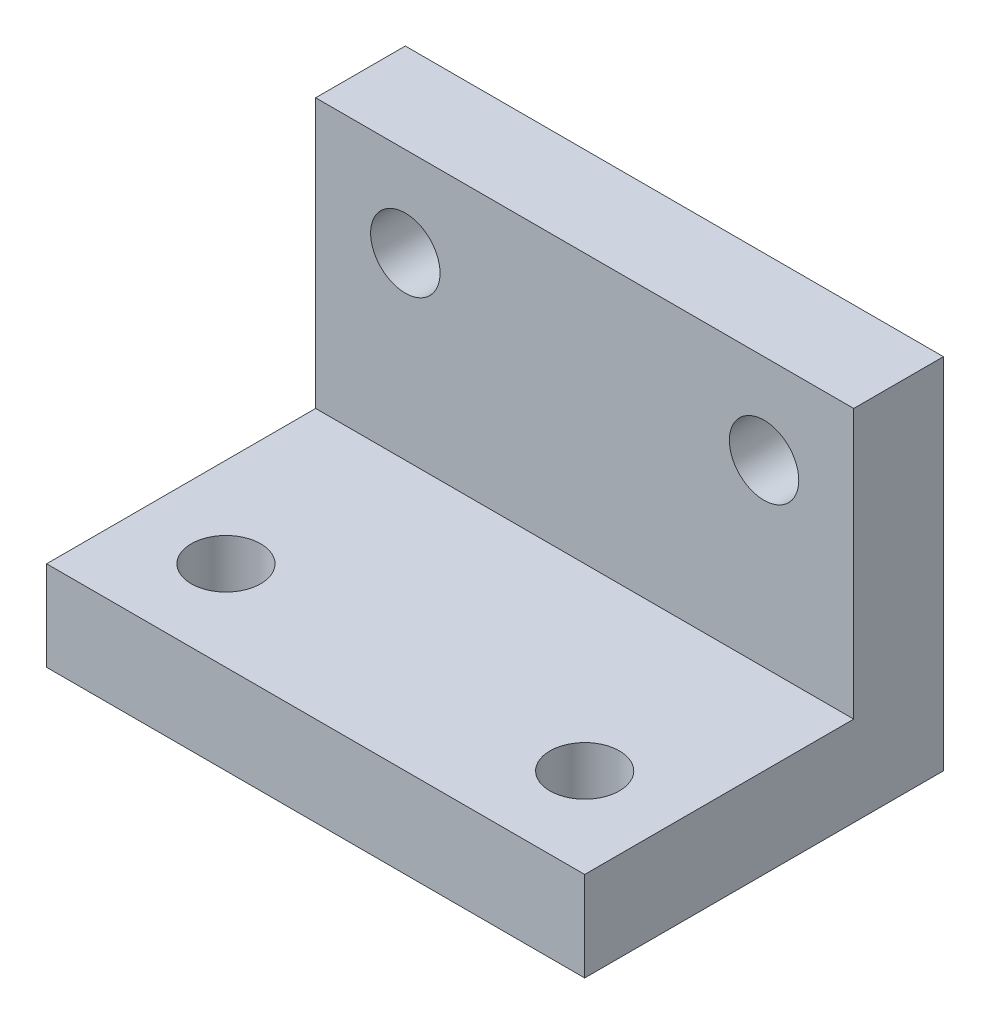
ISO-10303-21;
HEADER;
FILE_DESCRIPTION(('STEP AP214'),'2;1');
FILE_NAME('part.step','',(''),(''),'','','');
FILE_SCHEMA(('AUTOMOTIVE_DESIGN { 1 0 10303 214 1 1 1 1 }'));
ENDSEC;
DATA;
#1=APPLICATION_CONTEXT('core data for automotive mechanical design processes');
#2=APPLICATION_PROTOCOL_DEFINITION('international standard','automotive_design',2000,#1);
#3=PRODUCT_CONTEXT('',#1,'mechanical');
#4=PRODUCT('Part','Part','',(#3));
#5=PRODUCT_RELATED_PRODUCT_CATEGORY('part','',(#4));
#6=PRODUCT_DEFINITION_FORMATION('','',#4);
#7=PRODUCT_DEFINITION_CONTEXT('part definition',#1,'design');
#8=PRODUCT_DEFINITION('design','',#6,#7);
#9=PRODUCT_DEFINITION_SHAPE('','',#8);
#10=(LENGTH_UNIT() NAMED_UNIT(*) SI_UNIT(.MILLI.,.METRE.));
#11=(NAMED_UNIT(*) PLANE_ANGLE_UNIT() SI_UNIT($,.RADIAN.));
#12=(NAMED_UNIT(*) SI_UNIT($,.STERADIAN.) SOLID_ANGLE_UNIT());
#13=UNCERTAINTY_MEASURE_WITH_UNIT(LENGTH_MEASURE(1.E-05),#10,'distance_accuracy_value','');
#14=(GEOMETRIC_REPRESENTATION_CONTEXT(3) GLOBAL_UNCERTAINTY_ASSIGNED_CONTEXT((#13)) GLOBAL_UNIT_ASSIGNED_CONTEXT((#10,
#11,#12)) REPRESENTATION_CONTEXT('',''));
#15=CARTESIAN_POINT('',(0.,0.,0.));
#16=DIRECTION('',(0.,0.,1.));
#17=DIRECTION('',(1.,0.,0.));
#18=AXIS2_PLACEMENT_3D('',#15,#16,#17);
#19=CARTESIAN_POINT('',(-19.051,12.7,-6.34999999999999));
#20=DIRECTION('',(0.,0.,-1.));
#21=DIRECTION('',(-1.,0.,0.));
#22=AXIS2_PLACEMENT_3D('',#19,#20,#21);
#23=PLANE('',#22);
#24=CARTESIAN_POINT('',(-12.7,6.35,-6.35));
#25=DIRECTION('',(0.,0.,1.));
#26=DIRECTION('',(1.,0.,0.));
#27=AXIS2_PLACEMENT_3D('',#24,#25,#26);
#28=CIRCLE('',#27,2.45745);
#29=CARTESIAN_POINT('',(-10.24255,6.35,-6.35));
#30=VERTEX_POINT('',#29);
#31=EDGE_CURVE('E155',#30,#30,#28,.T.);
#32=ORIENTED_EDGE('',*,*,#31,.F.);
#33=EDGE_LOOP('',(#32));
#34=FACE_BOUND('',#33,.T.);
#35=DIRECTION('',(0.,-1.,0.));
#36=VECTOR('',#35,1.);
#37=CARTESIAN_POINT('',(-19.05,12.7,-6.34999999999999));
#38=LINE('',#37,#36);
#39=CARTESIAN_POINT('',(-19.05,12.7,-6.34999999999999));
#40=VERTEX_POINT('',#39);
#41=CARTESIAN_POINT('',(-19.05,-6.35,-6.34999999999999));
#42=VERTEX_POINT('',#41);
#43=EDGE_CURVE('E134',#40,#42,#38,.T.);
#44=ORIENTED_EDGE('',*,*,#43,.T.);
#45=DIRECTION('',(1.,0.,0.));
#46=VECTOR('',#45,1.);
#47=CARTESIAN_POINT('',(-19.051,-6.35,-6.34999999999999));
#48=LINE('',#47,#46);
#49=CARTESIAN_POINT('',(19.05,-6.35,-6.35));
#50=VERTEX_POINT('',#49);
#51=EDGE_CURVE('E135',#42,#50,#48,.T.);
#52=ORIENTED_EDGE('',*,*,#51,.T.);
#53=DIRECTION('',(0.,1.,0.));
#54=VECTOR('',#53,1.);
#55=CARTESIAN_POINT('',(19.05,12.7,-6.35));
#56=LINE('',#55,#54);
#57=CARTESIAN_POINT('',(19.05,12.7,-6.35));
#58=VERTEX_POINT('',#57);
#59=EDGE_CURVE('E49',#50,#58,#56,.T.);
#60=ORIENTED_EDGE('',*,*,#59,.T.);
#61=DIRECTION('',(1.,0.,0.));
#62=VECTOR('',#61,1.);
#63=CARTESIAN_POINT('',(-19.051,12.7,-6.34999999999999));
#64=LINE('',#63,#62);
#65=EDGE_CURVE('E104',#40,#58,#64,.T.);
#66=ORIENTED_EDGE('',*,*,#65,.F.);
#67=EDGE_LOOP('',(#44,#52,#60,#66));
#68=FACE_BOUND('',#67,.T.);
#69=CARTESIAN_POINT('',(12.7,6.35,-6.35));
#70=DIRECTION('',(0.,0.,1.));
#71=DIRECTION('',(1.,0.,0.));
#72=AXIS2_PLACEMENT_3D('',#69,#70,#71);
#73=CIRCLE('',#72,2.45745);
#74=CARTESIAN_POINT('',(15.15745,6.35,-6.35));
#75=VERTEX_POINT('',#74);
#76=EDGE_CURVE('E149',#75,#75,#73,.T.);
#77=ORIENTED_EDGE('',*,*,#76,.F.);
#78=EDGE_LOOP('',(#77));
#79=FACE_BOUND('',#78,.T.);
#80=ADVANCED_FACE('F34',(#34,#68,#79),#23,.F.);
#81=CARTESIAN_POINT('',(-19.05,12.7,-12.7));
#82=DIRECTION('',(1.,0.,0.));
#83=DIRECTION('',(0.,0.,-1.));
#84=AXIS2_PLACEMENT_3D('',#81,#82,#83);
#85=PLANE('',#84);
#86=DIRECTION('',(0.,0.,1.));
#87=VECTOR('',#86,1.);
#88=CARTESIAN_POINT('',(-19.05,-6.35,12.7));
#89=LINE('',#88,#87);
#90=CARTESIAN_POINT('',(-19.05,-6.35,12.7));
#91=VERTEX_POINT('',#90);
#92=EDGE_CURVE('E100',#42,#91,#89,.T.);
#93=ORIENTED_EDGE('',*,*,#92,.F.);
#94=ORIENTED_EDGE('',*,*,#43,.F.);
#95=DIRECTION('',(0.,0.,1.));
#96=VECTOR('',#95,1.);
#97=CARTESIAN_POINT('',(-19.05,12.7,-12.7));
#98=LINE('',#97,#96);
#99=CARTESIAN_POINT('',(-19.05,12.7,-12.7));
#100=VERTEX_POINT('',#99);
#101=EDGE_CURVE('E86',#100,#40,#98,.T.);
#102=ORIENTED_EDGE('',*,*,#101,.F.);
#103=DIRECTION('',(0.,-1.,0.));
#104=VECTOR('',#103,1.);
#105=CARTESIAN_POINT('',(-19.05,12.7,-12.7));
#106=LINE('',#105,#104);
#107=CARTESIAN_POINT('',(-19.05,-12.7,-12.7));
#108=VERTEX_POINT('',#107);
#109=EDGE_CURVE('E79',#100,#108,#106,.T.);
#110=ORIENTED_EDGE('',*,*,#109,.T.);
#111=DIRECTION('',(0.,0.,1.));
#112=VECTOR('',#111,1.);
#113=CARTESIAN_POINT('',(-19.05,-12.7,-12.7));
#114=LINE('',#113,#112);
#115=CARTESIAN_POINT('',(-19.05,-12.7,12.7));
#116=VERTEX_POINT('',#115);
#117=EDGE_CURVE('E93',#108,#116,#114,.T.);
#118=ORIENTED_EDGE('',*,*,#117,.T.);
#119=DIRECTION('',(0.,-1.,0.));
#120=VECTOR('',#119,1.);
#121=CARTESIAN_POINT('',(-19.05,12.7,12.7));
#122=LINE('',#121,#120);
#123=EDGE_CURVE('E11',#91,#116,#122,.T.);
#124=ORIENTED_EDGE('',*,*,#123,.F.);
#125=EDGE_LOOP('',(#93,#94,#102,#110,#118,#124));
#126=FACE_BOUND('',#125,.T.);
#127=ADVANCED_FACE('F36',(#126),#85,.F.);
#128=CARTESIAN_POINT('',(-19.05,12.7,12.7));
#129=DIRECTION('',(0.,0.,-1.));
#130=DIRECTION('',(-1.,0.,0.));
#131=AXIS2_PLACEMENT_3D('',#128,#129,#130);
#132=PLANE('',#131);
#133=DIRECTION('',(0.,-1.,0.));
#134=VECTOR('',#133,1.);
#135=CARTESIAN_POINT('',(19.05,12.7,12.7));
#136=LINE('',#135,#134);
#137=CARTESIAN_POINT('',(19.05,-6.35,12.7));
#138=VERTEX_POINT('',#137);
#139=CARTESIAN_POINT('',(19.05,-12.7,12.7));
#140=VERTEX_POINT('',#139);
#141=EDGE_CURVE('E42',#138,#140,#136,.T.);
#142=ORIENTED_EDGE('',*,*,#141,.F.);
#143=DIRECTION('',(1.,0.,0.));
#144=VECTOR('',#143,1.);
#145=CARTESIAN_POINT('',(-19.051,-6.35,12.7));
#146=LINE('',#145,#144);
#147=EDGE_CURVE('E123',#91,#138,#146,.T.);
#148=ORIENTED_EDGE('',*,*,#147,.F.);
#149=ORIENTED_EDGE('',*,*,#123,.T.);
#150=DIRECTION('',(1.,0.,0.));
#151=VECTOR('',#150,1.);
#152=CARTESIAN_POINT('',(-19.05,-12.7,12.7));
#153=LINE('',#152,#151);
#154=EDGE_CURVE('E99',#116,#140,#153,.T.);
#155=ORIENTED_EDGE('',*,*,#154,.T.);
#156=EDGE_LOOP('',(#142,#148,#149,#155));
#157=FACE_BOUND('',#156,.T.);
#158=ADVANCED_FACE('F120',(#157),#132,.F.);
#159=CARTESIAN_POINT('',(19.05,12.7,-12.7));
#160=DIRECTION('',(-1.,0.,0.));
#161=DIRECTION('',(0.,0.,1.));
#162=AXIS2_PLACEMENT_3D('',#159,#160,#161);
#163=PLANE('',#162);
#164=DIRECTION('',(0.,0.,-1.));
#165=VECTOR('',#164,1.);
#166=CARTESIAN_POINT('',(19.05,12.7,-12.7));
#167=LINE('',#166,#165);
#168=CARTESIAN_POINT('',(19.05,12.7,-12.7));
#169=VERTEX_POINT('',#168);
#170=EDGE_CURVE('E140',#58,#169,#167,.T.);
#171=ORIENTED_EDGE('',*,*,#170,.F.);
#172=ORIENTED_EDGE('',*,*,#59,.F.);
#173=DIRECTION('',(0.,0.,-1.));
#174=VECTOR('',#173,1.);
#175=CARTESIAN_POINT('',(19.05,-6.35,12.7));
#176=LINE('',#175,#174);
#177=EDGE_CURVE('E117',#138,#50,#176,.T.);
#178=ORIENTED_EDGE('',*,*,#177,.F.);
#179=ORIENTED_EDGE('',*,*,#141,.T.);
#180=DIRECTION('',(0.,0.,-1.));
#181=VECTOR('',#180,1.);
#182=CARTESIAN_POINT('',(19.05,-12.7,-12.7));
#183=LINE('',#182,#181);
#184=CARTESIAN_POINT('',(19.05,-12.7,-12.7));
#185=VERTEX_POINT('',#184);
#186=EDGE_CURVE('E87',#140,#185,#183,.T.);
#187=ORIENTED_EDGE('',*,*,#186,.T.);
#188=DIRECTION('',(0.,-1.,0.));
#189=VECTOR('',#188,1.);
#190=CARTESIAN_POINT('',(19.05,12.7,-12.7));
#191=LINE('',#190,#189);
#192=EDGE_CURVE('E82',#169,#185,#191,.T.);
#193=ORIENTED_EDGE('',*,*,#192,.F.);
#194=EDGE_LOOP('',(#171,#172,#178,#179,#187,#193));
#195=FACE_BOUND('',#194,.T.);
#196=ADVANCED_FACE('F114',(#195),#163,.F.);
#197=CARTESIAN_POINT('',(-19.05,12.7,-12.7));
#198=DIRECTION('',(0.,0.,1.));
#199=DIRECTION('',(1.,0.,0.));
#200=AXIS2_PLACEMENT_3D('',#197,#198,#199);
#201=PLANE('',#200);
#202=CARTESIAN_POINT('',(-12.7,6.35,-12.7));
#203=DIRECTION('',(0.,0.,1.));
#204=DIRECTION('',(1.,0.,0.));
#205=AXIS2_PLACEMENT_3D('',#202,#203,#204);
#206=CIRCLE('',#205,2.45745);
#207=CARTESIAN_POINT('',(-10.24255,6.35,-12.7));
#208=VERTEX_POINT('',#207);
#209=EDGE_CURVE('E152',#208,#208,#206,.T.);
#210=ORIENTED_EDGE('',*,*,#209,.T.);
#211=EDGE_LOOP('',(#210));
#212=FACE_BOUND('',#211,.T.);
#213=CARTESIAN_POINT('',(12.7,6.35,-12.7));
#214=DIRECTION('',(0.,0.,1.));
#215=DIRECTION('',(1.,0.,0.));
#216=AXIS2_PLACEMENT_3D('',#213,#214,#215);
#217=CIRCLE('',#216,2.45745);
#218=CARTESIAN_POINT('',(15.15745,6.35,-12.7));
#219=VERTEX_POINT('',#218);
#220=EDGE_CURVE('E137',#219,#219,#217,.T.);
#221=ORIENTED_EDGE('',*,*,#220,.T.);
#222=EDGE_LOOP('',(#221));
#223=FACE_BOUND('',#222,.T.);
#224=DIRECTION('',(-1.,0.,0.));
#225=VECTOR('',#224,1.);
#226=CARTESIAN_POINT('',(-19.05,-12.7,-12.7));
#227=LINE('',#226,#225);
#228=EDGE_CURVE('E76',#185,#108,#227,.T.);
#229=ORIENTED_EDGE('',*,*,#228,.T.);
#230=ORIENTED_EDGE('',*,*,#109,.F.);
#231=DIRECTION('',(-1.,0.,0.));
#232=VECTOR('',#231,1.);
#233=CARTESIAN_POINT('',(-19.05,12.7,-12.7));
#234=LINE('',#233,#232);
#235=EDGE_CURVE('E58',#169,#100,#234,.T.);
#236=ORIENTED_EDGE('',*,*,#235,.F.);
#237=ORIENTED_EDGE('',*,*,#192,.T.);
#238=EDGE_LOOP('',(#229,#230,#236,#237));
#239=FACE_BOUND('',#238,.T.);
#240=ADVANCED_FACE('F78',(#212,#223,#239),#201,.F.);
#241=CARTESIAN_POINT('',(0.,12.7,0.));
#242=DIRECTION('',(0.,1.,0.));
#243=DIRECTION('',(0.,0.,1.));
#244=AXIS2_PLACEMENT_3D('',#241,#242,#243);
#245=PLANE('',#244);
#246=ORIENTED_EDGE('',*,*,#65,.T.);
#247=ORIENTED_EDGE('',*,*,#170,.T.);
#248=ORIENTED_EDGE('',*,*,#235,.T.);
#249=ORIENTED_EDGE('',*,*,#101,.T.);
#250=EDGE_LOOP('',(#246,#247,#248,#249));
#251=FACE_BOUND('',#250,.T.);
#252=ADVANCED_FACE('F139',(#251),#245,.T.);
#253=CARTESIAN_POINT('',(0.,-12.7,0.));
#254=DIRECTION('',(0.,1.,0.));
#255=DIRECTION('',(0.,0.,1.));
#256=AXIS2_PLACEMENT_3D('',#253,#254,#255);
#257=PLANE('',#256);
#258=CARTESIAN_POINT('',(-12.7,-12.7,6.35000000000001));
#259=DIRECTION('',(0.,1.,0.));
#260=DIRECTION('',(0.,0.,1.));
#261=AXIS2_PLACEMENT_3D('',#258,#259,#260);
#262=CIRCLE('',#261,2.45745);
#263=CARTESIAN_POINT('',(-12.7,-12.7,8.80745000000001));
#264=VERTEX_POINT('',#263);
#265=EDGE_CURVE('E164',#264,#264,#262,.T.);
#266=ORIENTED_EDGE('',*,*,#265,.T.);
#267=EDGE_LOOP('',(#266));
#268=FACE_BOUND('',#267,.T.);
#269=CARTESIAN_POINT('',(12.7,-12.7,6.35000000000001));
#270=DIRECTION('',(0.,1.,0.));
#271=DIRECTION('',(0.,0.,1.));
#272=AXIS2_PLACEMENT_3D('',#269,#270,#271);
#273=CIRCLE('',#272,2.45745);
#274=CARTESIAN_POINT('',(12.7,-12.7,8.80745000000001));
#275=VERTEX_POINT('',#274);
#276=EDGE_CURVE('E158',#275,#275,#273,.T.);
#277=ORIENTED_EDGE('',*,*,#276,.T.);
#278=EDGE_LOOP('',(#277));
#279=FACE_BOUND('',#278,.T.);
#280=ORIENTED_EDGE('',*,*,#117,.F.);
#281=ORIENTED_EDGE('',*,*,#228,.F.);
#282=ORIENTED_EDGE('',*,*,#186,.F.);
#283=ORIENTED_EDGE('',*,*,#154,.F.);
#284=EDGE_LOOP('',(#280,#281,#282,#283));
#285=FACE_BOUND('',#284,.T.);
#286=ADVANCED_FACE('F97',(#268,#279,#285),#257,.F.);
#287=CARTESIAN_POINT('',(-19.051,-6.35,12.7));
#288=DIRECTION('',(0.,-1.,0.));
#289=DIRECTION('',(0.,0.,-1.));
#290=AXIS2_PLACEMENT_3D('',#287,#288,#289);
#291=PLANE('',#290);
#292=CARTESIAN_POINT('',(-12.7,-6.35,6.35000000000001));
#293=DIRECTION('',(0.,1.,0.));
#294=DIRECTION('',(0.,0.,1.));
#295=AXIS2_PLACEMENT_3D('',#292,#293,#294);
#296=CIRCLE('',#295,2.45745);
#297=CARTESIAN_POINT('',(-12.7,-6.35,8.80745000000001));
#298=VERTEX_POINT('',#297);
#299=EDGE_CURVE('E167',#298,#298,#296,.T.);
#300=ORIENTED_EDGE('',*,*,#299,.F.);
#301=EDGE_LOOP('',(#300));
#302=FACE_BOUND('',#301,.T.);
#303=CARTESIAN_POINT('',(12.7,-6.35,6.35000000000001));
#304=DIRECTION('',(0.,1.,0.));
#305=DIRECTION('',(0.,0.,1.));
#306=AXIS2_PLACEMENT_3D('',#303,#304,#305);
#307=CIRCLE('',#306,2.45745);
#308=CARTESIAN_POINT('',(12.7,-6.35,8.80745000000001));
#309=VERTEX_POINT('',#308);
#310=EDGE_CURVE('E161',#309,#309,#307,.T.);
#311=ORIENTED_EDGE('',*,*,#310,.F.);
#312=EDGE_LOOP('',(#311));
#313=FACE_BOUND('',#312,.T.);
#314=ORIENTED_EDGE('',*,*,#92,.T.);
#315=ORIENTED_EDGE('',*,*,#147,.T.);
#316=ORIENTED_EDGE('',*,*,#177,.T.);
#317=ORIENTED_EDGE('',*,*,#51,.F.);
#318=EDGE_LOOP('',(#314,#315,#316,#317));
#319=FACE_BOUND('',#318,.T.);
#320=ADVANCED_FACE('F174',(#302,#313,#319),#291,.F.);
#321=CARTESIAN_POINT('',(12.7,6.35,-6.35));
#322=DIRECTION('',(0.,0.,1.));
#323=DIRECTION('',(1.,0.,0.));
#324=AXIS2_PLACEMENT_3D('',#321,#322,#323);
#325=CYLINDRICAL_SURFACE('',#324,2.45745);
#326=ORIENTED_EDGE('',*,*,#220,.F.);
#327=EDGE_LOOP('',(#326));
#328=FACE_BOUND('',#327,.T.);
#329=ORIENTED_EDGE('',*,*,#76,.T.);
#330=EDGE_LOOP('',(#329));
#331=FACE_BOUND('',#330,.T.);
#332=ADVANCED_FACE('F177',(#328,#331),#325,.F.);
#333=CARTESIAN_POINT('',(-12.7,6.35,-6.35));
#334=DIRECTION('',(0.,0.,1.));
#335=DIRECTION('',(1.,0.,0.));
#336=AXIS2_PLACEMENT_3D('',#333,#334,#335);
#337=CYLINDRICAL_SURFACE('',#336,2.45745);
#338=ORIENTED_EDGE('',*,*,#209,.F.);
#339=EDGE_LOOP('',(#338));
#340=FACE_BOUND('',#339,.T.);
#341=ORIENTED_EDGE('',*,*,#31,.T.);
#342=EDGE_LOOP('',(#341));
#343=FACE_BOUND('',#342,.T.);
#344=ADVANCED_FACE('F184',(#340,#343),#337,.F.);
#345=CARTESIAN_POINT('',(12.7,-6.35,6.35000000000001));
#346=DIRECTION('',(0.,1.,0.));
#347=DIRECTION('',(0.,0.,1.));
#348=AXIS2_PLACEMENT_3D('',#345,#346,#347);
#349=CYLINDRICAL_SURFACE('',#348,2.45745);
#350=ORIENTED_EDGE('',*,*,#310,.T.);
#351=EDGE_LOOP('',(#350));
#352=FACE_BOUND('',#351,.T.);
#353=ORIENTED_EDGE('',*,*,#276,.F.);
#354=EDGE_LOOP('',(#353));
#355=FACE_BOUND('',#354,.T.);
#356=ADVANCED_FACE('F181',(#352,#355),#349,.F.);
#357=CARTESIAN_POINT('',(-12.7,-6.35,6.35000000000001));
#358=DIRECTION('',(0.,1.,0.));
#359=DIRECTION('',(0.,0.,1.));
#360=AXIS2_PLACEMENT_3D('',#357,#358,#359);
#361=CYLINDRICAL_SURFACE('',#360,2.45745);
#362=ORIENTED_EDGE('',*,*,#299,.T.);
#363=EDGE_LOOP('',(#362));
#364=FACE_BOUND('',#363,.T.);
#365=ORIENTED_EDGE('',*,*,#265,.F.);
#366=EDGE_LOOP('',(#365));
#367=FACE_BOUND('',#366,.T.);
#368=ADVANCED_FACE('F171',(#364,#367),#361,.F.);
#369=CLOSED_SHELL('',(#80,#127,#158,#196,#240,#252,#286,#320,#332,#344,#356,#368));
#370=MANIFOLD_SOLID_BREP('B2',#369);
#371=ADVANCED_BREP_SHAPE_REPRESENTATION('',(#18,#370),#14);
#372=SHAPE_DEFINITION_REPRESENTATION(#9,#371);
ENDSEC;
END-ISO-10303-21;
